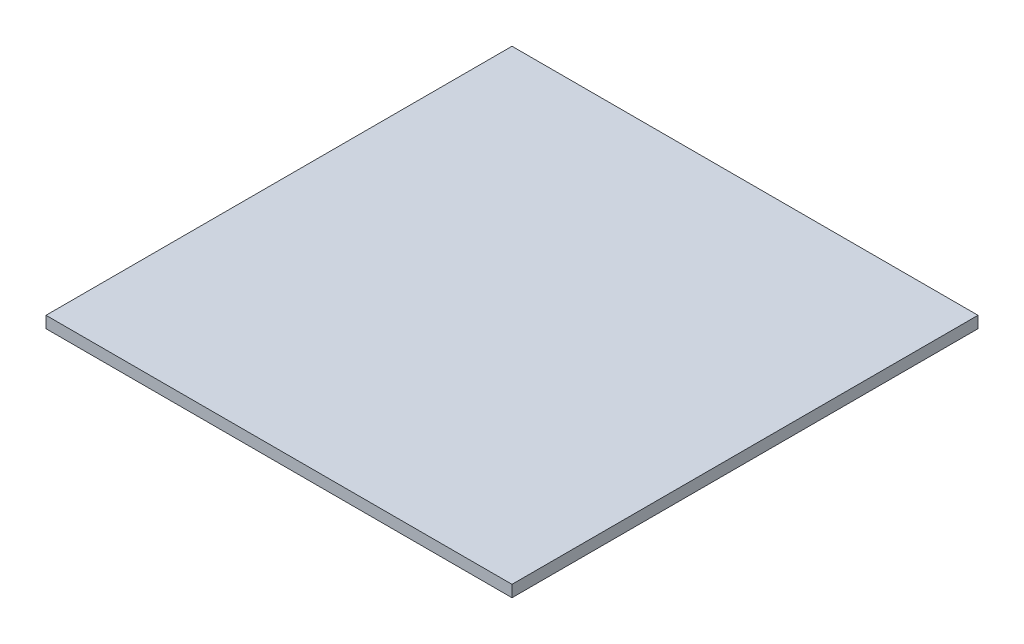
ISO-10303-21;
HEADER;
FILE_DESCRIPTION(('STEP AP214'),'2;1');
FILE_NAME('part.step','',(''),(''),'','','');
FILE_SCHEMA(('AUTOMOTIVE_DESIGN { 1 0 10303 214 1 1 1 1 }'));
ENDSEC;
DATA;
#1=APPLICATION_CONTEXT('core data for automotive mechanical design processes');
#2=APPLICATION_PROTOCOL_DEFINITION('international standard','automotive_design',2000,#1);
#3=PRODUCT_CONTEXT('',#1,'mechanical');
#4=PRODUCT('Part','Part','',(#3));
#5=PRODUCT_RELATED_PRODUCT_CATEGORY('part','',(#4));
#6=PRODUCT_DEFINITION_FORMATION('','',#4);
#7=PRODUCT_DEFINITION_CONTEXT('part definition',#1,'design');
#8=PRODUCT_DEFINITION('design','',#6,#7);
#9=PRODUCT_DEFINITION_SHAPE('','',#8);
#10=(LENGTH_UNIT() NAMED_UNIT(*) SI_UNIT(.MILLI.,.METRE.));
#11=(NAMED_UNIT(*) PLANE_ANGLE_UNIT() SI_UNIT($,.RADIAN.));
#12=(NAMED_UNIT(*) SI_UNIT($,.STERADIAN.) SOLID_ANGLE_UNIT());
#13=UNCERTAINTY_MEASURE_WITH_UNIT(LENGTH_MEASURE(1.E-05),#10,'distance_accuracy_value','');
#14=(GEOMETRIC_REPRESENTATION_CONTEXT(3) GLOBAL_UNCERTAINTY_ASSIGNED_CONTEXT((#13)) GLOBAL_UNIT_ASSIGNED_CONTEXT((#10,
#11,#12)) REPRESENTATION_CONTEXT('',''));
#15=CARTESIAN_POINT('',(0.,0.,0.));
#16=DIRECTION('',(0.,0.,1.));
#17=DIRECTION('',(1.,0.,0.));
#18=AXIS2_PLACEMENT_3D('',#15,#16,#17);
#19=CARTESIAN_POINT('',(100.,5.,-100.));
#20=DIRECTION('',(-1.,0.,0.));
#21=DIRECTION('',(0.,0.,1.));
#22=AXIS2_PLACEMENT_3D('',#19,#20,#21);
#23=PLANE('',#22);
#24=DIRECTION('',(0.,0.,-1.));
#25=VECTOR('',#24,1.);
#26=CARTESIAN_POINT('',(100.,0.,-100.));
#27=LINE('',#26,#25);
#28=CARTESIAN_POINT('',(100.,0.,100.));
#29=VERTEX_POINT('',#28);
#30=CARTESIAN_POINT('',(100.,0.,-100.));
#31=VERTEX_POINT('',#30);
#32=EDGE_CURVE('E97',#29,#31,#27,.T.);
#33=ORIENTED_EDGE('',*,*,#32,.T.);
#34=DIRECTION('',(0.,-1.,0.));
#35=VECTOR('',#34,1.);
#36=CARTESIAN_POINT('',(100.,5.,-100.));
#37=LINE('',#36,#35);
#38=CARTESIAN_POINT('',(100.,5.,-100.));
#39=VERTEX_POINT('',#38);
#40=EDGE_CURVE('E11',#39,#31,#37,.T.);
#41=ORIENTED_EDGE('',*,*,#40,.F.);
#42=DIRECTION('',(0.,0.,-1.));
#43=VECTOR('',#42,1.);
#44=CARTESIAN_POINT('',(100.,5.,-100.));
#45=LINE('',#44,#43);
#46=CARTESIAN_POINT('',(100.,5.,100.));
#47=VERTEX_POINT('',#46);
#48=EDGE_CURVE('E85',#47,#39,#45,.T.);
#49=ORIENTED_EDGE('',*,*,#48,.F.);
#50=DIRECTION('',(0.,-1.,0.));
#51=VECTOR('',#50,1.);
#52=CARTESIAN_POINT('',(100.,5.,100.));
#53=LINE('',#52,#51);
#54=EDGE_CURVE('E93',#47,#29,#53,.T.);
#55=ORIENTED_EDGE('',*,*,#54,.T.);
#56=EDGE_LOOP('',(#33,#41,#49,#55));
#57=FACE_BOUND('',#56,.T.);
#58=ADVANCED_FACE('F34',(#57),#23,.F.);
#59=CARTESIAN_POINT('',(-100.,5.,-100.));
#60=DIRECTION('',(0.,0.,1.));
#61=DIRECTION('',(1.,0.,0.));
#62=AXIS2_PLACEMENT_3D('',#59,#60,#61);
#63=PLANE('',#62);
#64=DIRECTION('',(-1.,0.,0.));
#65=VECTOR('',#64,1.);
#66=CARTESIAN_POINT('',(-100.,0.,-100.));
#67=LINE('',#66,#65);
#68=CARTESIAN_POINT('',(-100.,0.,-100.));
#69=VERTEX_POINT('',#68);
#70=EDGE_CURVE('E89',#31,#69,#67,.T.);
#71=ORIENTED_EDGE('',*,*,#70,.T.);
#72=DIRECTION('',(0.,-1.,0.));
#73=VECTOR('',#72,1.);
#74=CARTESIAN_POINT('',(-100.,5.,-100.));
#75=LINE('',#74,#73);
#76=CARTESIAN_POINT('',(-100.,5.,-100.));
#77=VERTEX_POINT('',#76);
#78=EDGE_CURVE('E42',#77,#69,#75,.T.);
#79=ORIENTED_EDGE('',*,*,#78,.F.);
#80=DIRECTION('',(-1.,0.,0.));
#81=VECTOR('',#80,1.);
#82=CARTESIAN_POINT('',(-100.,5.,-100.));
#83=LINE('',#82,#81);
#84=EDGE_CURVE('E80',#39,#77,#83,.T.);
#85=ORIENTED_EDGE('',*,*,#84,.F.);
#86=ORIENTED_EDGE('',*,*,#40,.T.);
#87=EDGE_LOOP('',(#71,#79,#85,#86));
#88=FACE_BOUND('',#87,.T.);
#89=ADVANCED_FACE('F88',(#88),#63,.F.);
#90=CARTESIAN_POINT('',(-100.,5.,-100.));
#91=DIRECTION('',(1.,0.,0.));
#92=DIRECTION('',(0.,0.,-1.));
#93=AXIS2_PLACEMENT_3D('',#90,#91,#92);
#94=PLANE('',#93);
#95=DIRECTION('',(0.,0.,1.));
#96=VECTOR('',#95,1.);
#97=CARTESIAN_POINT('',(-100.,0.,-100.));
#98=LINE('',#97,#96);
#99=CARTESIAN_POINT('',(-100.,0.,100.));
#100=VERTEX_POINT('',#99);
#101=EDGE_CURVE('E67',#69,#100,#98,.T.);
#102=ORIENTED_EDGE('',*,*,#101,.T.);
#103=DIRECTION('',(0.,-1.,0.));
#104=VECTOR('',#103,1.);
#105=CARTESIAN_POINT('',(-100.,5.,100.));
#106=LINE('',#105,#104);
#107=CARTESIAN_POINT('',(-100.,5.,100.));
#108=VERTEX_POINT('',#107);
#109=EDGE_CURVE('E90',#108,#100,#106,.T.);
#110=ORIENTED_EDGE('',*,*,#109,.F.);
#111=DIRECTION('',(0.,0.,1.));
#112=VECTOR('',#111,1.);
#113=CARTESIAN_POINT('',(-100.,5.,-100.));
#114=LINE('',#113,#112);
#115=EDGE_CURVE('E83',#77,#108,#114,.T.);
#116=ORIENTED_EDGE('',*,*,#115,.F.);
#117=ORIENTED_EDGE('',*,*,#78,.T.);
#118=EDGE_LOOP('',(#102,#110,#116,#117));
#119=FACE_BOUND('',#118,.T.);
#120=ADVANCED_FACE('F91',(#119),#94,.F.);
#121=CARTESIAN_POINT('',(-100.,5.,100.));
#122=DIRECTION('',(0.,0.,-1.));
#123=DIRECTION('',(-1.,0.,0.));
#124=AXIS2_PLACEMENT_3D('',#121,#122,#123);
#125=PLANE('',#124);
#126=DIRECTION('',(1.,0.,0.));
#127=VECTOR('',#126,1.);
#128=CARTESIAN_POINT('',(-100.,0.,100.));
#129=LINE('',#128,#127);
#130=EDGE_CURVE('E73',#100,#29,#129,.T.);
#131=ORIENTED_EDGE('',*,*,#130,.T.);
#132=ORIENTED_EDGE('',*,*,#54,.F.);
#133=DIRECTION('',(1.,0.,0.));
#134=VECTOR('',#133,1.);
#135=CARTESIAN_POINT('',(-100.,5.,100.));
#136=LINE('',#135,#134);
#137=EDGE_CURVE('E50',#108,#47,#136,.T.);
#138=ORIENTED_EDGE('',*,*,#137,.F.);
#139=ORIENTED_EDGE('',*,*,#109,.T.);
#140=EDGE_LOOP('',(#131,#132,#138,#139));
#141=FACE_BOUND('',#140,.T.);
#142=ADVANCED_FACE('F104',(#141),#125,.F.);
#143=CARTESIAN_POINT('',(0.,5.,0.));
#144=DIRECTION('',(0.,1.,0.));
#145=DIRECTION('',(0.,0.,1.));
#146=AXIS2_PLACEMENT_3D('',#143,#144,#145);
#147=PLANE('',#146);
#148=ORIENTED_EDGE('',*,*,#48,.T.);
#149=ORIENTED_EDGE('',*,*,#84,.T.);
#150=ORIENTED_EDGE('',*,*,#115,.T.);
#151=ORIENTED_EDGE('',*,*,#137,.T.);
#152=EDGE_LOOP('',(#148,#149,#150,#151));
#153=FACE_BOUND('',#152,.T.);
#154=ADVANCED_FACE('F81',(#153),#147,.T.);
#155=CARTESIAN_POINT('',(0.,0.,0.));
#156=DIRECTION('',(0.,1.,0.));
#157=DIRECTION('',(0.,0.,1.));
#158=AXIS2_PLACEMENT_3D('',#155,#156,#157);
#159=PLANE('',#158);
#160=ORIENTED_EDGE('',*,*,#32,.F.);
#161=ORIENTED_EDGE('',*,*,#130,.F.);
#162=ORIENTED_EDGE('',*,*,#101,.F.);
#163=ORIENTED_EDGE('',*,*,#70,.F.);
#164=EDGE_LOOP('',(#160,#161,#162,#163));
#165=FACE_BOUND('',#164,.T.);
#166=ADVANCED_FACE('F107',(#165),#159,.F.);
#167=CLOSED_SHELL('',(#58,#89,#120,#142,#154,#166));
#168=MANIFOLD_SOLID_BREP('B2',#167);
#169=ADVANCED_BREP_SHAPE_REPRESENTATION('',(#18,#168),#14);
#170=SHAPE_DEFINITION_REPRESENTATION(#9,#169);
ENDSEC;
END-ISO-10303-21;
